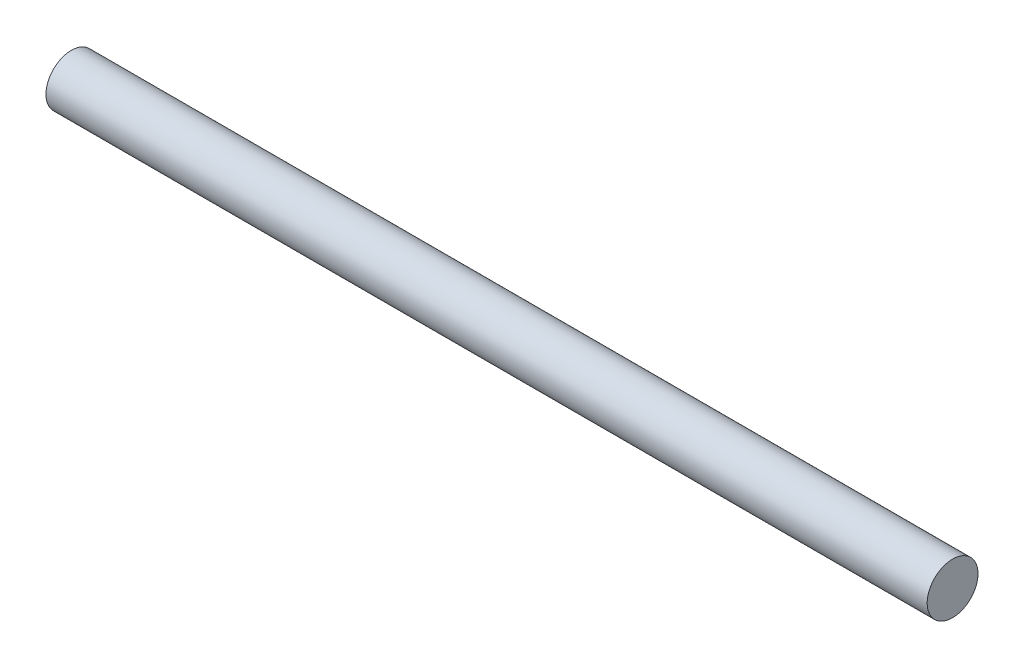
ISO-10303-21;
HEADER;
FILE_DESCRIPTION(('STEP AP214'),'2;1');
FILE_NAME('part.step','',(''),(''),'','','');
FILE_SCHEMA(('AUTOMOTIVE_DESIGN { 1 0 10303 214 1 1 1 1 }'));
ENDSEC;
DATA;
#1=APPLICATION_CONTEXT('core data for automotive mechanical design processes');
#2=APPLICATION_PROTOCOL_DEFINITION('international standard','automotive_design',2000,#1);
#3=PRODUCT_CONTEXT('',#1,'mechanical');
#4=PRODUCT('Part','Part','',(#3));
#5=PRODUCT_RELATED_PRODUCT_CATEGORY('part','',(#4));
#6=PRODUCT_DEFINITION_FORMATION('','',#4);
#7=PRODUCT_DEFINITION_CONTEXT('part definition',#1,'design');
#8=PRODUCT_DEFINITION('design','',#6,#7);
#9=PRODUCT_DEFINITION_SHAPE('','',#8);
#10=(LENGTH_UNIT() NAMED_UNIT(*) SI_UNIT(.MILLI.,.METRE.));
#11=(NAMED_UNIT(*) PLANE_ANGLE_UNIT() SI_UNIT($,.RADIAN.));
#12=(NAMED_UNIT(*) SI_UNIT($,.STERADIAN.) SOLID_ANGLE_UNIT());
#13=UNCERTAINTY_MEASURE_WITH_UNIT(LENGTH_MEASURE(1.E-05),#10,'distance_accuracy_value','');
#14=(GEOMETRIC_REPRESENTATION_CONTEXT(3) GLOBAL_UNCERTAINTY_ASSIGNED_CONTEXT((#13)) GLOBAL_UNIT_ASSIGNED_CONTEXT((#10,
#11,#12)) REPRESENTATION_CONTEXT('',''));
#15=CARTESIAN_POINT('',(0.,0.,0.));
#16=DIRECTION('',(0.,0.,1.));
#17=DIRECTION('',(1.,0.,0.));
#18=AXIS2_PLACEMENT_3D('',#15,#16,#17);
#19=CARTESIAN_POINT('',(26.,11.0629921714462,22.6945002168009));
#20=DIRECTION('',(-1.,0.,0.));
#21=DIRECTION('',(0.,0.,1.));
#22=AXIS2_PLACEMENT_3D('',#19,#20,#21);
#23=CYLINDRICAL_SURFACE('',#22,0.750000000000002);
#24=CARTESIAN_POINT('',(26.,11.0629921714462,22.6945002168009));
#25=DIRECTION('',(1.,0.,0.));
#26=DIRECTION('',(0.,0.,-1.));
#27=AXIS2_PLACEMENT_3D('',#24,#25,#26);
#28=CIRCLE('',#27,0.750000000000002);
#29=CARTESIAN_POINT('',(26.,11.0629921714462,21.9445002168009));
#30=VERTEX_POINT('',#29);
#31=EDGE_CURVE('E10',#30,#30,#28,.T.);
#32=ORIENTED_EDGE('',*,*,#31,.F.);
#33=EDGE_LOOP('',(#32));
#34=FACE_BOUND('',#33,.T.);
#35=CARTESIAN_POINT('',(0.,11.0629921714462,22.6945002168009));
#36=DIRECTION('',(1.,0.,0.));
#37=DIRECTION('',(0.,0.,-1.));
#38=AXIS2_PLACEMENT_3D('',#35,#36,#37);
#39=CIRCLE('',#38,0.750000000000002);
#40=CARTESIAN_POINT('',(0.,11.0629921714462,21.9445002168009));
#41=VERTEX_POINT('',#40);
#42=EDGE_CURVE('E39',#41,#41,#39,.T.);
#43=ORIENTED_EDGE('',*,*,#42,.T.);
#44=EDGE_LOOP('',(#43));
#45=FACE_BOUND('',#44,.T.);
#46=ADVANCED_FACE('F36',(#34,#45),#23,.T.);
#47=CARTESIAN_POINT('',(26.,11.0629921714462,22.6945002168009));
#48=DIRECTION('',(1.,0.,0.));
#49=DIRECTION('',(0.,0.,-1.));
#50=AXIS2_PLACEMENT_3D('',#47,#48,#49);
#51=PLANE('',#50);
#52=ORIENTED_EDGE('',*,*,#31,.T.);
#53=EDGE_LOOP('',(#52));
#54=FACE_BOUND('',#53,.T.);
#55=ADVANCED_FACE('F51',(#54),#51,.T.);
#56=CARTESIAN_POINT('',(0.,11.0629921714462,22.6945002168009));
#57=DIRECTION('',(1.,0.,0.));
#58=DIRECTION('',(0.,0.,-1.));
#59=AXIS2_PLACEMENT_3D('',#56,#57,#58);
#60=PLANE('',#59);
#61=ORIENTED_EDGE('',*,*,#42,.F.);
#62=EDGE_LOOP('',(#61));
#63=FACE_BOUND('',#62,.T.);
#64=ADVANCED_FACE('F49',(#63),#60,.F.);
#65=CLOSED_SHELL('',(#46,#55,#64));
#66=MANIFOLD_SOLID_BREP('B2',#65);
#67=ADVANCED_BREP_SHAPE_REPRESENTATION('',(#18,#66),#14);
#68=SHAPE_DEFINITION_REPRESENTATION(#9,#67);
ENDSEC;
END-ISO-10303-21;
